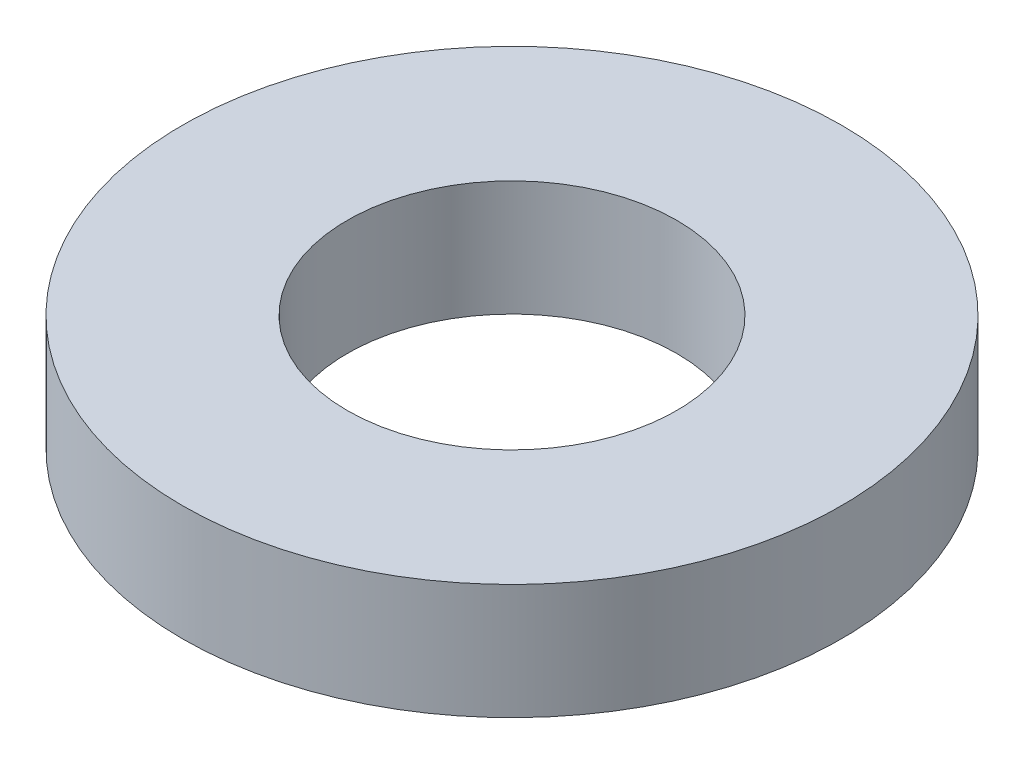
ISO-10303-21;
HEADER;
FILE_DESCRIPTION(('STEP AP214'),'2;1');
FILE_NAME('part.step','',(''),(''),'','','');
FILE_SCHEMA(('AUTOMOTIVE_DESIGN { 1 0 10303 214 1 1 1 1 }'));
ENDSEC;
DATA;
#1=APPLICATION_CONTEXT('core data for automotive mechanical design processes');
#2=APPLICATION_PROTOCOL_DEFINITION('international standard','automotive_design',2000,#1);
#3=PRODUCT_CONTEXT('',#1,'mechanical');
#4=PRODUCT('Part','Part','',(#3));
#5=PRODUCT_RELATED_PRODUCT_CATEGORY('part','',(#4));
#6=PRODUCT_DEFINITION_FORMATION('','',#4);
#7=PRODUCT_DEFINITION_CONTEXT('part definition',#1,'design');
#8=PRODUCT_DEFINITION('design','',#6,#7);
#9=PRODUCT_DEFINITION_SHAPE('','',#8);
#10=(LENGTH_UNIT() NAMED_UNIT(*) SI_UNIT(.MILLI.,.METRE.));
#11=(NAMED_UNIT(*) PLANE_ANGLE_UNIT() SI_UNIT($,.RADIAN.));
#12=(NAMED_UNIT(*) SI_UNIT($,.STERADIAN.) SOLID_ANGLE_UNIT());
#13=UNCERTAINTY_MEASURE_WITH_UNIT(LENGTH_MEASURE(1.E-05),#10,'distance_accuracy_value','');
#14=(GEOMETRIC_REPRESENTATION_CONTEXT(3) GLOBAL_UNCERTAINTY_ASSIGNED_CONTEXT((#13)) GLOBAL_UNIT_ASSIGNED_CONTEXT((#10,
#11,#12)) REPRESENTATION_CONTEXT('',''));
#15=CARTESIAN_POINT('',(0.,0.,0.));
#16=DIRECTION('',(0.,0.,1.));
#17=DIRECTION('',(1.,0.,0.));
#18=AXIS2_PLACEMENT_3D('',#15,#16,#17);
#19=CARTESIAN_POINT('',(0.,21.,0.));
#20=DIRECTION('',(0.,-1.,0.));
#21=DIRECTION('',(0.,0.,-1.));
#22=AXIS2_PLACEMENT_3D('',#19,#20,#21);
#23=CYLINDRICAL_SURFACE('',#22,60.);
#24=CARTESIAN_POINT('',(0.,21.,0.));
#25=DIRECTION('',(0.,1.,0.));
#26=DIRECTION('',(0.,0.,1.));
#27=AXIS2_PLACEMENT_3D('',#24,#25,#26);
#28=CIRCLE('',#27,60.);
#29=CARTESIAN_POINT('',(0.,21.,-60.));
#30=VERTEX_POINT('',#29);
#31=EDGE_CURVE('E10',#30,#30,#28,.T.);
#32=CARTESIAN_POINT('',(0.,0.,0.));
#33=DIRECTION('',(0.,1.,0.));
#34=DIRECTION('',(0.,0.,1.));
#35=AXIS2_PLACEMENT_3D('',#32,#33,#34);
#36=CIRCLE('',#35,60.);
#37=CARTESIAN_POINT('',(0.,0.,-60.));
#38=VERTEX_POINT('',#37);
#39=EDGE_CURVE('E37',#38,#38,#36,.T.);
#40=CARTESIAN_POINT('',(0.,21.,-60.));
#41=CARTESIAN_POINT('',(0.,20.78125,-60.));
#42=CARTESIAN_POINT('',(0.,20.5625,-60.));
#43=CARTESIAN_POINT('',(0.,20.125,-60.));
#44=CARTESIAN_POINT('',(0.,19.90625,-60.));
#45=CARTESIAN_POINT('',(0.,19.46875,-60.));
#46=CARTESIAN_POINT('',(0.,19.25,-60.));
#47=CARTESIAN_POINT('',(0.,18.8125,-60.));
#48=CARTESIAN_POINT('',(0.,18.59375,-60.));
#49=CARTESIAN_POINT('',(0.,18.15625,-60.));
#50=CARTESIAN_POINT('',(0.,17.9375,-60.));
#51=CARTESIAN_POINT('',(0.,17.5,-60.));
#52=CARTESIAN_POINT('',(0.,17.28125,-60.));
#53=CARTESIAN_POINT('',(0.,16.84375,-60.));
#54=CARTESIAN_POINT('',(0.,16.625,-60.));
#55=CARTESIAN_POINT('',(0.,16.1875,-60.));
#56=CARTESIAN_POINT('',(0.,15.96875,-60.));
#57=CARTESIAN_POINT('',(0.,15.53125,-60.));
#58=CARTESIAN_POINT('',(0.,15.3125,-60.));
#59=CARTESIAN_POINT('',(0.,14.875,-60.));
#60=CARTESIAN_POINT('',(0.,14.65625,-60.));
#61=CARTESIAN_POINT('',(0.,14.21875,-60.));
#62=CARTESIAN_POINT('',(0.,14.,-60.));
#63=CARTESIAN_POINT('',(0.,13.5625,-60.));
#64=CARTESIAN_POINT('',(0.,13.34375,-60.));
#65=CARTESIAN_POINT('',(0.,12.90625,-60.));
#66=CARTESIAN_POINT('',(0.,12.6875,-60.));
#67=CARTESIAN_POINT('',(0.,12.25,-60.));
#68=CARTESIAN_POINT('',(0.,12.03125,-60.));
#69=CARTESIAN_POINT('',(0.,11.59375,-60.));
#70=CARTESIAN_POINT('',(0.,11.375,-60.));
#71=CARTESIAN_POINT('',(0.,10.9375,-60.));
#72=CARTESIAN_POINT('',(0.,10.71875,-60.));
#73=CARTESIAN_POINT('',(0.,10.28125,-60.));
#74=CARTESIAN_POINT('',(0.,10.0625,-60.));
#75=CARTESIAN_POINT('',(0.,9.625,-60.));
#76=CARTESIAN_POINT('',(0.,9.40625,-60.));
#77=CARTESIAN_POINT('',(0.,8.96875,-60.));
#78=CARTESIAN_POINT('',(0.,8.75,-60.));
#79=CARTESIAN_POINT('',(0.,8.3125,-60.));
#80=CARTESIAN_POINT('',(0.,8.09375,-60.));
#81=CARTESIAN_POINT('',(0.,7.65625,-60.));
#82=CARTESIAN_POINT('',(0.,7.4375,-60.));
#83=CARTESIAN_POINT('',(0.,7.,-60.));
#84=CARTESIAN_POINT('',(0.,6.78125,-60.));
#85=CARTESIAN_POINT('',(0.,6.34375,-60.));
#86=CARTESIAN_POINT('',(0.,6.125,-60.));
#87=CARTESIAN_POINT('',(0.,5.6875,-60.));
#88=CARTESIAN_POINT('',(0.,5.46875,-60.));
#89=CARTESIAN_POINT('',(0.,5.03125,-60.));
#90=CARTESIAN_POINT('',(0.,4.8125,-60.));
#91=CARTESIAN_POINT('',(0.,4.375,-60.));
#92=CARTESIAN_POINT('',(0.,4.15625,-60.));
#93=CARTESIAN_POINT('',(0.,3.71875,-60.));
#94=CARTESIAN_POINT('',(0.,3.5,-60.));
#95=CARTESIAN_POINT('',(0.,3.0625,-60.));
#96=CARTESIAN_POINT('',(0.,2.84375,-60.));
#97=CARTESIAN_POINT('',(0.,2.40625,-60.));
#98=CARTESIAN_POINT('',(0.,2.1875,-60.));
#99=CARTESIAN_POINT('',(0.,1.75,-60.));
#100=CARTESIAN_POINT('',(0.,1.53125,-60.));
#101=CARTESIAN_POINT('',(0.,1.09375,-60.));
#102=CARTESIAN_POINT('',(0.,0.875000000000001,-60.));
#103=CARTESIAN_POINT('',(0.,0.4375,-60.));
#104=CARTESIAN_POINT('',(0.,0.21875,-60.));
#105=CARTESIAN_POINT('',(0.,0.,-60.));
#106=B_SPLINE_CURVE_WITH_KNOTS('',3,(#40,#41,#42,#43,#44,#45,#46,#47,#48,#49,#50,#51,#52,#53,
#54,#55,#56,#57,#58,#59,#60,#61,#62,#63,#64,#65,#66,#67,#68,#69,#70,#71,#72,#73,#74,#75,#76,#77,
#78,#79,#80,#81,#82,#83,#84,#85,#86,#87,#88,#89,#90,#91,#92,#93,#94,#95,#96,#97,#98,#99,#100,
#101,#102,#103,#104,#105),.UNSPECIFIED.,.F.,.F.,(4,2,2,2,2,2,2,2,2,2,2,2,2,2,2,2,2,2,2,2,2,2,2,
2,2,2,2,2,2,2,2,2,4),(0.,0.656250000000001,1.3125,1.96875,2.625,3.28125,3.9375,4.59375,5.25,
5.90625,6.5625,7.21875,7.875,8.53125,9.1875,9.84375,10.5,11.15625,11.8125,12.46875,13.125,
13.78125,14.4375,15.09375,15.75,16.40625,17.0625,17.71875,18.375,19.03125,19.6875,20.34375,21.),.UNSPECIFIED.);
#107=EDGE_CURVE('BSEAM40',#30,#38,#106,.T.);
#108=ORIENTED_EDGE('',*,*,#31,.F.);
#109=ORIENTED_EDGE('',*,*,#39,.T.);
#110=ORIENTED_EDGE('',*,*,#107,.T.);
#111=ORIENTED_EDGE('',*,*,#107,.F.);
#112=EDGE_LOOP('',(#108,#110,#109,#111));
#113=FACE_BOUND('',#112,.T.);
#114=ADVANCED_FACE('F40',(#113),#23,.T.);
#115=CARTESIAN_POINT('',(0.,21.,0.));
#116=DIRECTION('',(0.,1.,0.));
#117=DIRECTION('',(0.,0.,1.));
#118=AXIS2_PLACEMENT_3D('',#115,#116,#117);
#119=PLANE('',#118);
#120=CARTESIAN_POINT('',(0.,21.,0.));
#121=DIRECTION('',(0.,1.,0.));
#122=DIRECTION('',(0.,0.,1.));
#123=AXIS2_PLACEMENT_3D('',#120,#121,#122);
#124=CIRCLE('',#123,30.);
#125=CARTESIAN_POINT('',(0.,21.,-30.));
#126=VERTEX_POINT('',#125);
#127=EDGE_CURVE('E50',#126,#126,#124,.T.);
#128=ORIENTED_EDGE('',*,*,#127,.F.);
#129=EDGE_LOOP('',(#128));
#130=FACE_BOUND('',#129,.T.);
#131=ORIENTED_EDGE('',*,*,#31,.T.);
#132=EDGE_LOOP('',(#131));
#133=FACE_BOUND('',#132,.T.);
#134=ADVANCED_FACE('F59',(#130,#133),#119,.T.);
#135=CARTESIAN_POINT('',(0.,0.,0.));
#136=DIRECTION('',(0.,1.,0.));
#137=DIRECTION('',(0.,0.,1.));
#138=AXIS2_PLACEMENT_3D('',#135,#136,#137);
#139=PLANE('',#138);
#140=CARTESIAN_POINT('',(0.,0.,0.));
#141=DIRECTION('',(0.,1.,0.));
#142=DIRECTION('',(0.,0.,1.));
#143=AXIS2_PLACEMENT_3D('',#140,#141,#142);
#144=CIRCLE('',#143,30.);
#145=CARTESIAN_POINT('',(0.,0.,-30.));
#146=VERTEX_POINT('',#145);
#147=EDGE_CURVE('E47',#146,#146,#144,.T.);
#148=ORIENTED_EDGE('',*,*,#147,.T.);
#149=EDGE_LOOP('',(#148));
#150=FACE_BOUND('',#149,.T.);
#151=ORIENTED_EDGE('',*,*,#39,.F.);
#152=EDGE_LOOP('',(#151));
#153=FACE_BOUND('',#152,.T.);
#154=ADVANCED_FACE('F58',(#150,#153),#139,.F.);
#155=CARTESIAN_POINT('',(0.,21.,0.));
#156=DIRECTION('',(0.,-1.,0.));
#157=DIRECTION('',(0.,0.,-1.));
#158=AXIS2_PLACEMENT_3D('',#155,#156,#157);
#159=CYLINDRICAL_SURFACE('',#158,30.);
#160=CARTESIAN_POINT('',(0.,21.,-30.));
#161=CARTESIAN_POINT('',(0.,20.78125,-30.));
#162=CARTESIAN_POINT('',(0.,20.5625,-30.));
#163=CARTESIAN_POINT('',(0.,20.125,-30.));
#164=CARTESIAN_POINT('',(0.,19.90625,-30.));
#165=CARTESIAN_POINT('',(0.,19.46875,-30.));
#166=CARTESIAN_POINT('',(0.,19.25,-30.));
#167=CARTESIAN_POINT('',(0.,18.8125,-30.));
#168=CARTESIAN_POINT('',(0.,18.59375,-30.));
#169=CARTESIAN_POINT('',(0.,18.15625,-30.));
#170=CARTESIAN_POINT('',(0.,17.9375,-30.));
#171=CARTESIAN_POINT('',(0.,17.5,-30.));
#172=CARTESIAN_POINT('',(0.,17.28125,-30.));
#173=CARTESIAN_POINT('',(0.,16.84375,-30.));
#174=CARTESIAN_POINT('',(0.,16.625,-30.));
#175=CARTESIAN_POINT('',(0.,16.1875,-30.));
#176=CARTESIAN_POINT('',(0.,15.96875,-30.));
#177=CARTESIAN_POINT('',(0.,15.53125,-30.));
#178=CARTESIAN_POINT('',(0.,15.3125,-30.));
#179=CARTESIAN_POINT('',(0.,14.875,-30.));
#180=CARTESIAN_POINT('',(0.,14.65625,-30.));
#181=CARTESIAN_POINT('',(0.,14.21875,-30.));
#182=CARTESIAN_POINT('',(0.,14.,-30.));
#183=CARTESIAN_POINT('',(0.,13.5625,-30.));
#184=CARTESIAN_POINT('',(0.,13.34375,-30.));
#185=CARTESIAN_POINT('',(0.,12.90625,-30.));
#186=CARTESIAN_POINT('',(0.,12.6875,-30.));
#187=CARTESIAN_POINT('',(0.,12.25,-30.));
#188=CARTESIAN_POINT('',(0.,12.03125,-30.));
#189=CARTESIAN_POINT('',(0.,11.59375,-30.));
#190=CARTESIAN_POINT('',(0.,11.375,-30.));
#191=CARTESIAN_POINT('',(0.,10.9375,-30.));
#192=CARTESIAN_POINT('',(0.,10.71875,-30.));
#193=CARTESIAN_POINT('',(0.,10.28125,-30.));
#194=CARTESIAN_POINT('',(0.,10.0625,-30.));
#195=CARTESIAN_POINT('',(0.,9.625,-30.));
#196=CARTESIAN_POINT('',(0.,9.40625,-30.));
#197=CARTESIAN_POINT('',(0.,8.96875,-30.));
#198=CARTESIAN_POINT('',(0.,8.75,-30.));
#199=CARTESIAN_POINT('',(0.,8.3125,-30.));
#200=CARTESIAN_POINT('',(0.,8.09375,-30.));
#201=CARTESIAN_POINT('',(0.,7.65625,-30.));
#202=CARTESIAN_POINT('',(0.,7.4375,-30.));
#203=CARTESIAN_POINT('',(0.,7.,-30.));
#204=CARTESIAN_POINT('',(0.,6.78125,-30.));
#205=CARTESIAN_POINT('',(0.,6.34375,-30.));
#206=CARTESIAN_POINT('',(0.,6.125,-30.));
#207=CARTESIAN_POINT('',(0.,5.6875,-30.));
#208=CARTESIAN_POINT('',(0.,5.46875,-30.));
#209=CARTESIAN_POINT('',(0.,5.03125,-30.));
#210=CARTESIAN_POINT('',(0.,4.8125,-30.));
#211=CARTESIAN_POINT('',(0.,4.375,-30.));
#212=CARTESIAN_POINT('',(0.,4.15625,-30.));
#213=CARTESIAN_POINT('',(0.,3.71875,-30.));
#214=CARTESIAN_POINT('',(0.,3.5,-30.));
#215=CARTESIAN_POINT('',(0.,3.0625,-30.));
#216=CARTESIAN_POINT('',(0.,2.84375,-30.));
#217=CARTESIAN_POINT('',(0.,2.40625,-30.));
#218=CARTESIAN_POINT('',(0.,2.1875,-30.));
#219=CARTESIAN_POINT('',(0.,1.75,-30.));
#220=CARTESIAN_POINT('',(0.,1.53125,-30.));
#221=CARTESIAN_POINT('',(0.,1.09375,-30.));
#222=CARTESIAN_POINT('',(0.,0.875000000000001,-30.));
#223=CARTESIAN_POINT('',(0.,0.4375,-30.));
#224=CARTESIAN_POINT('',(0.,0.21875,-30.));
#225=CARTESIAN_POINT('',(0.,0.,-30.));
#226=B_SPLINE_CURVE_WITH_KNOTS('',3,(#160,#161,#162,#163,#164,#165,#166,#167,#168,#169,#170,
#171,#172,#173,#174,#175,#176,#177,#178,#179,#180,#181,#182,#183,#184,#185,#186,#187,#188,#189,
#190,#191,#192,#193,#194,#195,#196,#197,#198,#199,#200,#201,#202,#203,#204,#205,#206,#207,#208,
#209,#210,#211,#212,#213,#214,#215,#216,#217,#218,#219,#220,#221,#222,#223,#224,#225),
.UNSPECIFIED.,.F.,.F.,(4,2,2,2,2,2,2,2,2,2,2,2,2,2,2,2,2,2,2,2,2,2,2,2,2,2,2,2,2,2,2,2,4),(0.,
0.656249999999997,1.3125,1.96875,2.625,3.28125,3.9375,4.59375,5.25,5.90625,6.5625,7.21875,7.875,
8.53125,9.1875,9.84375,10.5,11.15625,11.8125,12.46875,13.125,13.78125,14.4375,15.09375,15.75,
16.40625,17.0625,17.71875,18.375,19.03125,19.6875,20.34375,21.),.UNSPECIFIED.);
#227=EDGE_CURVE('BSEAM54',#126,#146,#226,.T.);
#228=ORIENTED_EDGE('',*,*,#127,.T.);
#229=ORIENTED_EDGE('',*,*,#147,.F.);
#230=ORIENTED_EDGE('',*,*,#227,.T.);
#231=ORIENTED_EDGE('',*,*,#227,.F.);
#232=EDGE_LOOP('',(#228,#230,#229,#231));
#233=FACE_BOUND('',#232,.T.);
#234=ADVANCED_FACE('F54',(#233),#159,.F.);
#235=CLOSED_SHELL('',(#114,#134,#154,#234));
#236=MANIFOLD_SOLID_BREP('B2',#235);
#237=ADVANCED_BREP_SHAPE_REPRESENTATION('',(#18,#236),#14);
#238=SHAPE_DEFINITION_REPRESENTATION(#9,#237);
ENDSEC;
END-ISO-10303-21;
